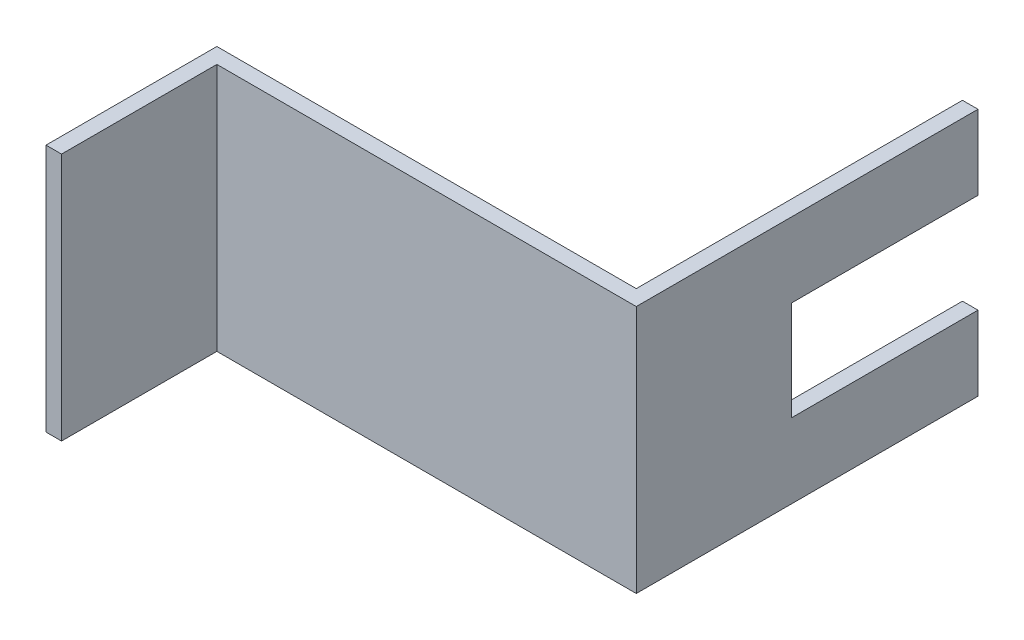
ISO-10303-21;
HEADER;
FILE_DESCRIPTION(('STEP AP214'),'2;1');
FILE_NAME('part.step','',(''),(''),'','','');
FILE_SCHEMA(('AUTOMOTIVE_DESIGN { 1 0 10303 214 1 1 1 1 }'));
ENDSEC;
DATA;
#1=APPLICATION_CONTEXT('core data for automotive mechanical design processes');
#2=APPLICATION_PROTOCOL_DEFINITION('international standard','automotive_design',2000,#1);
#3=PRODUCT_CONTEXT('',#1,'mechanical');
#4=PRODUCT('Part','Part','',(#3));
#5=PRODUCT_RELATED_PRODUCT_CATEGORY('part','',(#4));
#6=PRODUCT_DEFINITION_FORMATION('','',#4);
#7=PRODUCT_DEFINITION_CONTEXT('part definition',#1,'design');
#8=PRODUCT_DEFINITION('design','',#6,#7);
#9=PRODUCT_DEFINITION_SHAPE('','',#8);
#10=(LENGTH_UNIT() NAMED_UNIT(*) SI_UNIT(.MILLI.,.METRE.));
#11=(NAMED_UNIT(*) PLANE_ANGLE_UNIT() SI_UNIT($,.RADIAN.));
#12=(NAMED_UNIT(*) SI_UNIT($,.STERADIAN.) SOLID_ANGLE_UNIT());
#13=UNCERTAINTY_MEASURE_WITH_UNIT(LENGTH_MEASURE(1.E-05),#10,'distance_accuracy_value','');
#14=(GEOMETRIC_REPRESENTATION_CONTEXT(3) GLOBAL_UNCERTAINTY_ASSIGNED_CONTEXT((#13)) GLOBAL_UNIT_ASSIGNED_CONTEXT((#10,
#11,#12)) REPRESENTATION_CONTEXT('',''));
#15=CARTESIAN_POINT('',(0.,0.,0.));
#16=DIRECTION('',(0.,0.,1.));
#17=DIRECTION('',(1.,0.,0.));
#18=AXIS2_PLACEMENT_3D('',#15,#16,#17);
#19=CARTESIAN_POINT('',(7.61995771801081E-13,25.4,-26.8591148249153));
#20=DIRECTION('',(0.,0.,1.));
#21=DIRECTION('',(1.,0.,0.));
#22=AXIS2_PLACEMENT_3D('',#19,#20,#21);
#23=PLANE('',#22);
#24=DIRECTION('',(0.,-1.,0.));
#25=VECTOR('',#24,1.);
#26=CARTESIAN_POINT('',(28.0639133228681,25.4,-26.8591148249145));
#27=LINE('',#26,#25);
#28=CARTESIAN_POINT('',(28.0639133228681,7.62,-26.8591148249146));
#29=VERTEX_POINT('',#28);
#30=CARTESIAN_POINT('',(28.0639133228681,0.,-26.8591148249145));
#31=VERTEX_POINT('',#30);
#32=EDGE_CURVE('E165',#29,#31,#27,.T.);
#33=ORIENTED_EDGE('',*,*,#32,.F.);
#34=DIRECTION('',(1.,0.,0.));
#35=VECTOR('',#34,1.);
#36=CARTESIAN_POINT('',(4.25141332286807,7.62,-26.8591148249146));
#37=LINE('',#36,#35);
#38=CARTESIAN_POINT('',(29.6514133228681,7.62,-26.8591148249146));
#39=VERTEX_POINT('',#38);
#40=EDGE_CURVE('E146',#29,#39,#37,.T.);
#41=ORIENTED_EDGE('',*,*,#40,.T.);
#42=DIRECTION('',(0.,-1.,0.));
#43=VECTOR('',#42,1.);
#44=CARTESIAN_POINT('',(29.6514133228681,25.4,-26.8591148249145));
#45=LINE('',#44,#43);
#46=CARTESIAN_POINT('',(29.6514133228681,0.,-26.8591148249145));
#47=VERTEX_POINT('',#46);
#48=EDGE_CURVE('E169',#39,#47,#45,.T.);
#49=ORIENTED_EDGE('',*,*,#48,.T.);
#50=DIRECTION('',(-1.,0.,0.));
#51=VECTOR('',#50,1.);
#52=CARTESIAN_POINT('',(7.61995771801081E-13,0.,-26.8591148249153));
#53=LINE('',#52,#51);
#54=EDGE_CURVE('E151',#47,#31,#53,.T.);
#55=ORIENTED_EDGE('',*,*,#54,.T.);
#56=EDGE_LOOP('',(#33,#41,#49,#55));
#57=FACE_BOUND('',#56,.T.);
#58=ADVANCED_FACE('F34',(#57),#23,.F.);
#59=CARTESIAN_POINT('',(-13.2110866771319,25.4,0.));
#60=DIRECTION('',(-1.,0.,0.));
#61=DIRECTION('',(0.,0.,1.));
#62=AXIS2_PLACEMENT_3D('',#59,#60,#61);
#63=PLANE('',#62);
#64=DIRECTION('',(0.,0.,-1.));
#65=VECTOR('',#64,1.);
#66=CARTESIAN_POINT('',(-13.2110866771319,0.,0.));
#67=LINE('',#66,#65);
#68=CARTESIAN_POINT('',(-13.2110866771319,0.,23.9408851750854));
#69=VERTEX_POINT('',#68);
#70=CARTESIAN_POINT('',(-13.2110866771319,0.,8.06588517508544));
#71=VERTEX_POINT('',#70);
#72=EDGE_CURVE('E142',#69,#71,#67,.T.);
#73=ORIENTED_EDGE('',*,*,#72,.T.);
#74=DIRECTION('',(0.,-1.,0.));
#75=VECTOR('',#74,1.);
#76=CARTESIAN_POINT('',(-13.2110866771319,25.4,8.06588517508544));
#77=LINE('',#76,#75);
#78=CARTESIAN_POINT('',(-13.2110866771319,25.4,8.06588517508544));
#79=VERTEX_POINT('',#78);
#80=EDGE_CURVE('E176',#79,#71,#77,.T.);
#81=ORIENTED_EDGE('',*,*,#80,.F.);
#82=DIRECTION('',(0.,0.,-1.));
#83=VECTOR('',#82,1.);
#84=CARTESIAN_POINT('',(-13.2110866771319,25.4,0.));
#85=LINE('',#84,#83);
#86=CARTESIAN_POINT('',(-13.2110866771319,25.4,23.9408851750854));
#87=VERTEX_POINT('',#86);
#88=EDGE_CURVE('E161',#87,#79,#85,.T.);
#89=ORIENTED_EDGE('',*,*,#88,.F.);
#90=DIRECTION('',(0.,-1.,0.));
#91=VECTOR('',#90,1.);
#92=CARTESIAN_POINT('',(-13.2110866771319,25.4,23.9408851750854));
#93=LINE('',#92,#91);
#94=EDGE_CURVE('E138',#87,#69,#93,.T.);
#95=ORIENTED_EDGE('',*,*,#94,.T.);
#96=EDGE_LOOP('',(#73,#81,#89,#95));
#97=FACE_BOUND('',#96,.T.);
#98=ADVANCED_FACE('F36',(#97),#63,.F.);
#99=CARTESIAN_POINT('',(0.,25.4,8.06588517508544));
#100=DIRECTION('',(0.,0.,-1.));
#101=DIRECTION('',(-1.,0.,0.));
#102=AXIS2_PLACEMENT_3D('',#99,#100,#101);
#103=PLANE('',#102);
#104=DIRECTION('',(1.,0.,0.));
#105=VECTOR('',#104,1.);
#106=CARTESIAN_POINT('',(0.,0.,8.06588517508544));
#107=LINE('',#106,#105);
#108=CARTESIAN_POINT('',(29.6514133228681,0.,8.06588517508544));
#109=VERTEX_POINT('',#108);
#110=EDGE_CURVE('E145',#71,#109,#107,.T.);
#111=ORIENTED_EDGE('',*,*,#110,.T.);
#112=DIRECTION('',(0.,-1.,0.));
#113=VECTOR('',#112,1.);
#114=CARTESIAN_POINT('',(29.6514133228681,25.4,8.06588517508544));
#115=LINE('',#114,#113);
#116=CARTESIAN_POINT('',(29.6514133228681,25.4,8.06588517508544));
#117=VERTEX_POINT('',#116);
#118=EDGE_CURVE('E173',#117,#109,#115,.T.);
#119=ORIENTED_EDGE('',*,*,#118,.F.);
#120=DIRECTION('',(1.,0.,0.));
#121=VECTOR('',#120,1.);
#122=CARTESIAN_POINT('',(0.,25.4,8.06588517508544));
#123=LINE('',#122,#121);
#124=EDGE_CURVE('E100',#79,#117,#123,.T.);
#125=ORIENTED_EDGE('',*,*,#124,.F.);
#126=ORIENTED_EDGE('',*,*,#80,.T.);
#127=EDGE_LOOP('',(#111,#119,#125,#126));
#128=FACE_BOUND('',#127,.T.);
#129=ADVANCED_FACE('F229',(#128),#103,.F.);
#130=CARTESIAN_POINT('',(29.6514133228681,25.4,0.));
#131=DIRECTION('',(-1.,0.,0.));
#132=DIRECTION('',(0.,0.,1.));
#133=AXIS2_PLACEMENT_3D('',#130,#131,#132);
#134=PLANE('',#133);
#135=ORIENTED_EDGE('',*,*,#48,.F.);
#136=DIRECTION('',(0.,0.,-1.));
#137=VECTOR('',#136,1.);
#138=CARTESIAN_POINT('',(29.6514133228681,7.62,-26.8591148249146));
#139=LINE('',#138,#137);
#140=CARTESIAN_POINT('',(29.6514133228681,7.62,-7.80911482491456));
#141=VERTEX_POINT('',#140);
#142=EDGE_CURVE('E206',#141,#39,#139,.T.);
#143=ORIENTED_EDGE('',*,*,#142,.F.);
#144=DIRECTION('',(0.,-1.,0.));
#145=VECTOR('',#144,1.);
#146=CARTESIAN_POINT('',(29.6514133228681,17.78,-7.80911482491456));
#147=LINE('',#146,#145);
#148=CARTESIAN_POINT('',(29.6514133228681,17.78,-7.80911482491456));
#149=VERTEX_POINT('',#148);
#150=EDGE_CURVE('E210',#149,#141,#147,.T.);
#151=ORIENTED_EDGE('',*,*,#150,.F.);
#152=DIRECTION('',(0.,0.,1.));
#153=VECTOR('',#152,1.);
#154=CARTESIAN_POINT('',(29.6514133228681,17.78,-26.8591148249146));
#155=LINE('',#154,#153);
#156=CARTESIAN_POINT('',(29.6514133228681,17.78,-26.8591148249146));
#157=VERTEX_POINT('',#156);
#158=EDGE_CURVE('E235',#157,#149,#155,.T.);
#159=ORIENTED_EDGE('',*,*,#158,.F.);
#160=CARTESIAN_POINT('',(29.6514133228681,25.4,-26.8591148249145));
#161=VERTEX_POINT('',#160);
#162=EDGE_CURVE('E170',#161,#157,#45,.T.);
#163=ORIENTED_EDGE('',*,*,#162,.F.);
#164=DIRECTION('',(0.,0.,-1.));
#165=VECTOR('',#164,1.);
#166=CARTESIAN_POINT('',(29.6514133228681,25.4,0.));
#167=LINE('',#166,#165);
#168=EDGE_CURVE('E216',#117,#161,#167,.T.);
#169=ORIENTED_EDGE('',*,*,#168,.F.);
#170=ORIENTED_EDGE('',*,*,#118,.T.);
#171=DIRECTION('',(0.,0.,-1.));
#172=VECTOR('',#171,1.);
#173=CARTESIAN_POINT('',(29.6514133228681,0.,0.));
#174=LINE('',#173,#172);
#175=EDGE_CURVE('E148',#109,#47,#174,.T.);
#176=ORIENTED_EDGE('',*,*,#175,.T.);
#177=EDGE_LOOP('',(#135,#143,#151,#159,#163,#169,#170,#176));
#178=FACE_BOUND('',#177,.T.);
#179=ADVANCED_FACE('F233',(#178),#134,.F.);
#180=ORIENTED_EDGE('',*,*,#162,.T.);
#181=DIRECTION('',(1.,0.,0.));
#182=VECTOR('',#181,1.);
#183=CARTESIAN_POINT('',(4.25141332286807,17.78,-26.8591148249146));
#184=LINE('',#183,#182);
#185=CARTESIAN_POINT('',(28.0639133228681,17.78,-26.8591148249146));
#186=VERTEX_POINT('',#185);
#187=EDGE_CURVE('E198',#186,#157,#184,.T.);
#188=ORIENTED_EDGE('',*,*,#187,.F.);
#189=CARTESIAN_POINT('',(28.0639133228681,25.4,-26.8591148249145));
#190=VERTEX_POINT('',#189);
#191=EDGE_CURVE('E166',#190,#186,#27,.T.);
#192=ORIENTED_EDGE('',*,*,#191,.F.);
#193=DIRECTION('',(-1.,0.,0.));
#194=VECTOR('',#193,1.);
#195=CARTESIAN_POINT('',(7.61995771801081E-13,25.4,-26.8591148249153));
#196=LINE('',#195,#194);
#197=EDGE_CURVE('E218',#161,#190,#196,.T.);
#198=ORIENTED_EDGE('',*,*,#197,.F.);
#199=EDGE_LOOP('',(#180,#188,#192,#198));
#200=FACE_BOUND('',#199,.T.);
#201=ADVANCED_FACE('F203',(#200),#23,.F.);
#202=CARTESIAN_POINT('',(28.0639133228681,25.4,0.));
#203=DIRECTION('',(-1.,0.,0.));
#204=DIRECTION('',(0.,0.,1.));
#205=AXIS2_PLACEMENT_3D('',#202,#203,#204);
#206=PLANE('',#205);
#207=DIRECTION('',(0.,0.,1.));
#208=VECTOR('',#207,1.);
#209=CARTESIAN_POINT('',(28.0639133228681,7.62,0.));
#210=LINE('',#209,#208);
#211=CARTESIAN_POINT('',(28.0639133228681,7.62,-7.80911482491456));
#212=VERTEX_POINT('',#211);
#213=EDGE_CURVE('E11',#29,#212,#210,.T.);
#214=ORIENTED_EDGE('',*,*,#213,.F.);
#215=ORIENTED_EDGE('',*,*,#32,.T.);
#216=DIRECTION('',(0.,0.,-1.));
#217=VECTOR('',#216,1.);
#218=CARTESIAN_POINT('',(28.0639133228681,0.,0.));
#219=LINE('',#218,#217);
#220=CARTESIAN_POINT('',(28.0639133228681,0.,6.47838517508544));
#221=VERTEX_POINT('',#220);
#222=EDGE_CURVE('E154',#221,#31,#219,.T.);
#223=ORIENTED_EDGE('',*,*,#222,.F.);
#224=DIRECTION('',(0.,-1.,0.));
#225=VECTOR('',#224,1.);
#226=CARTESIAN_POINT('',(28.0639133228681,25.4,6.47838517508544));
#227=LINE('',#226,#225);
#228=CARTESIAN_POINT('',(28.0639133228681,25.4,6.47838517508544));
#229=VERTEX_POINT('',#228);
#230=EDGE_CURVE('E133',#229,#221,#227,.T.);
#231=ORIENTED_EDGE('',*,*,#230,.F.);
#232=DIRECTION('',(0.,0.,-1.));
#233=VECTOR('',#232,1.);
#234=CARTESIAN_POINT('',(28.0639133228681,25.4,0.));
#235=LINE('',#234,#233);
#236=EDGE_CURVE('E123',#229,#190,#235,.T.);
#237=ORIENTED_EDGE('',*,*,#236,.T.);
#238=ORIENTED_EDGE('',*,*,#191,.T.);
#239=DIRECTION('',(0.,0.,-1.));
#240=VECTOR('',#239,1.);
#241=CARTESIAN_POINT('',(28.0639133228681,17.78,0.));
#242=LINE('',#241,#240);
#243=CARTESIAN_POINT('',(28.0639133228681,17.78,-7.80911482491456));
#244=VERTEX_POINT('',#243);
#245=EDGE_CURVE('E178',#244,#186,#242,.T.);
#246=ORIENTED_EDGE('',*,*,#245,.F.);
#247=DIRECTION('',(0.,1.,0.));
#248=VECTOR('',#247,1.);
#249=CARTESIAN_POINT('',(28.0639133228681,25.4,-7.80911482491456));
#250=LINE('',#249,#248);
#251=EDGE_CURVE('E42',#212,#244,#250,.T.);
#252=ORIENTED_EDGE('',*,*,#251,.F.);
#253=EDGE_LOOP('',(#214,#215,#223,#231,#237,#238,#246,#252));
#254=FACE_BOUND('',#253,.T.);
#255=ADVANCED_FACE('F191',(#254),#206,.T.);
#256=CARTESIAN_POINT('',(0.,25.4,6.47838517508545));
#257=DIRECTION('',(0.,0.,1.));
#258=DIRECTION('',(1.,0.,0.));
#259=AXIS2_PLACEMENT_3D('',#256,#257,#258);
#260=PLANE('',#259);
#261=DIRECTION('',(-1.,0.,0.));
#262=VECTOR('',#261,1.);
#263=CARTESIAN_POINT('',(0.,0.,6.47838517508545));
#264=LINE('',#263,#262);
#265=CARTESIAN_POINT('',(-14.7985866771319,0.,6.47838517508545));
#266=VERTEX_POINT('',#265);
#267=EDGE_CURVE('E130',#221,#266,#264,.T.);
#268=ORIENTED_EDGE('',*,*,#267,.T.);
#269=DIRECTION('',(0.,-1.,0.));
#270=VECTOR('',#269,1.);
#271=CARTESIAN_POINT('',(-14.7985866771319,25.4,6.47838517508545));
#272=LINE('',#271,#270);
#273=CARTESIAN_POINT('',(-14.7985866771319,25.4,6.47838517508545));
#274=VERTEX_POINT('',#273);
#275=EDGE_CURVE('E127',#274,#266,#272,.T.);
#276=ORIENTED_EDGE('',*,*,#275,.F.);
#277=DIRECTION('',(-1.,0.,0.));
#278=VECTOR('',#277,1.);
#279=CARTESIAN_POINT('',(0.,25.4,6.47838517508545));
#280=LINE('',#279,#278);
#281=EDGE_CURVE('E116',#229,#274,#280,.T.);
#282=ORIENTED_EDGE('',*,*,#281,.F.);
#283=ORIENTED_EDGE('',*,*,#230,.T.);
#284=EDGE_LOOP('',(#268,#276,#282,#283));
#285=FACE_BOUND('',#284,.T.);
#286=ADVANCED_FACE('F128',(#285),#260,.F.);
#287=CARTESIAN_POINT('',(-14.7985866771319,25.4,0.));
#288=DIRECTION('',(1.,0.,0.));
#289=DIRECTION('',(0.,0.,-1.));
#290=AXIS2_PLACEMENT_3D('',#287,#288,#289);
#291=PLANE('',#290);
#292=DIRECTION('',(0.,0.,1.));
#293=VECTOR('',#292,1.);
#294=CARTESIAN_POINT('',(-14.7985866771319,0.,0.));
#295=LINE('',#294,#293);
#296=CARTESIAN_POINT('',(-14.7985866771319,0.,23.9408851750854));
#297=VERTEX_POINT('',#296);
#298=EDGE_CURVE('E158',#266,#297,#295,.T.);
#299=ORIENTED_EDGE('',*,*,#298,.T.);
#300=DIRECTION('',(0.,-1.,0.));
#301=VECTOR('',#300,1.);
#302=CARTESIAN_POINT('',(-14.7985866771319,25.4,23.9408851750854));
#303=LINE('',#302,#301);
#304=CARTESIAN_POINT('',(-14.7985866771319,25.4,23.9408851750854));
#305=VERTEX_POINT('',#304);
#306=EDGE_CURVE('E134',#305,#297,#303,.T.);
#307=ORIENTED_EDGE('',*,*,#306,.F.);
#308=DIRECTION('',(0.,0.,1.));
#309=VECTOR('',#308,1.);
#310=CARTESIAN_POINT('',(-14.7985866771319,25.4,0.));
#311=LINE('',#310,#309);
#312=EDGE_CURVE('E120',#274,#305,#311,.T.);
#313=ORIENTED_EDGE('',*,*,#312,.F.);
#314=ORIENTED_EDGE('',*,*,#275,.T.);
#315=EDGE_LOOP('',(#299,#307,#313,#314));
#316=FACE_BOUND('',#315,.T.);
#317=ADVANCED_FACE('F136',(#316),#291,.F.);
#318=CARTESIAN_POINT('',(0.,25.4,23.9408851750854));
#319=DIRECTION('',(0.,0.,-1.));
#320=DIRECTION('',(-1.,0.,0.));
#321=AXIS2_PLACEMENT_3D('',#318,#319,#320);
#322=PLANE('',#321);
#323=DIRECTION('',(1.,0.,0.));
#324=VECTOR('',#323,1.);
#325=CARTESIAN_POINT('',(0.,0.,23.9408851750854));
#326=LINE('',#325,#324);
#327=EDGE_CURVE('E91',#297,#69,#326,.T.);
#328=ORIENTED_EDGE('',*,*,#327,.T.);
#329=ORIENTED_EDGE('',*,*,#94,.F.);
#330=DIRECTION('',(1.,0.,0.));
#331=VECTOR('',#330,1.);
#332=CARTESIAN_POINT('',(0.,25.4,23.9408851750854));
#333=LINE('',#332,#331);
#334=EDGE_CURVE('E58',#305,#87,#333,.T.);
#335=ORIENTED_EDGE('',*,*,#334,.F.);
#336=ORIENTED_EDGE('',*,*,#306,.T.);
#337=EDGE_LOOP('',(#328,#329,#335,#336));
#338=FACE_BOUND('',#337,.T.);
#339=ADVANCED_FACE('F224',(#338),#322,.F.);
#340=CARTESIAN_POINT('',(0.,25.4,0.));
#341=DIRECTION('',(0.,1.,0.));
#342=DIRECTION('',(0.,0.,1.));
#343=AXIS2_PLACEMENT_3D('',#340,#341,#342);
#344=PLANE('',#343);
#345=ORIENTED_EDGE('',*,*,#88,.T.);
#346=ORIENTED_EDGE('',*,*,#124,.T.);
#347=ORIENTED_EDGE('',*,*,#168,.T.);
#348=ORIENTED_EDGE('',*,*,#197,.T.);
#349=ORIENTED_EDGE('',*,*,#236,.F.);
#350=ORIENTED_EDGE('',*,*,#281,.T.);
#351=ORIENTED_EDGE('',*,*,#312,.T.);
#352=ORIENTED_EDGE('',*,*,#334,.T.);
#353=EDGE_LOOP('',(#345,#346,#347,#348,#349,#350,#351,#352));
#354=FACE_BOUND('',#353,.T.);
#355=ADVANCED_FACE('F118',(#354),#344,.T.);
#356=CARTESIAN_POINT('',(0.,0.,0.));
#357=DIRECTION('',(0.,1.,0.));
#358=DIRECTION('',(0.,0.,1.));
#359=AXIS2_PLACEMENT_3D('',#356,#357,#358);
#360=PLANE('',#359);
#361=ORIENTED_EDGE('',*,*,#72,.F.);
#362=ORIENTED_EDGE('',*,*,#327,.F.);
#363=ORIENTED_EDGE('',*,*,#298,.F.);
#364=ORIENTED_EDGE('',*,*,#267,.F.);
#365=ORIENTED_EDGE('',*,*,#222,.T.);
#366=ORIENTED_EDGE('',*,*,#54,.F.);
#367=ORIENTED_EDGE('',*,*,#175,.F.);
#368=ORIENTED_EDGE('',*,*,#110,.F.);
#369=EDGE_LOOP('',(#361,#362,#363,#364,#365,#366,#367,#368));
#370=FACE_BOUND('',#369,.T.);
#371=ADVANCED_FACE('F222',(#370),#360,.F.);
#372=CARTESIAN_POINT('',(4.25141332286807,7.62,-26.8591148249146));
#373=DIRECTION('',(0.,-1.,0.));
#374=DIRECTION('',(0.,0.,-1.));
#375=AXIS2_PLACEMENT_3D('',#372,#373,#374);
#376=PLANE('',#375);
#377=ORIENTED_EDGE('',*,*,#213,.T.);
#378=DIRECTION('',(1.,0.,0.));
#379=VECTOR('',#378,1.);
#380=CARTESIAN_POINT('',(4.25141332286807,7.62,-7.80911482491456));
#381=LINE('',#380,#379);
#382=EDGE_CURVE('E188',#212,#141,#381,.T.);
#383=ORIENTED_EDGE('',*,*,#382,.T.);
#384=ORIENTED_EDGE('',*,*,#142,.T.);
#385=ORIENTED_EDGE('',*,*,#40,.F.);
#386=EDGE_LOOP('',(#377,#383,#384,#385));
#387=FACE_BOUND('',#386,.T.);
#388=ADVANCED_FACE('F244',(#387),#376,.F.);
#389=CARTESIAN_POINT('',(4.25141332286807,17.78,-7.80911482491456));
#390=DIRECTION('',(0.,0.,1.));
#391=DIRECTION('',(1.,0.,0.));
#392=AXIS2_PLACEMENT_3D('',#389,#390,#391);
#393=PLANE('',#392);
#394=ORIENTED_EDGE('',*,*,#251,.T.);
#395=DIRECTION('',(1.,0.,0.));
#396=VECTOR('',#395,1.);
#397=CARTESIAN_POINT('',(4.25141332286807,17.78,-7.80911482491456));
#398=LINE('',#397,#396);
#399=EDGE_CURVE('E49',#244,#149,#398,.T.);
#400=ORIENTED_EDGE('',*,*,#399,.T.);
#401=ORIENTED_EDGE('',*,*,#150,.T.);
#402=ORIENTED_EDGE('',*,*,#382,.F.);
#403=EDGE_LOOP('',(#394,#400,#401,#402));
#404=FACE_BOUND('',#403,.T.);
#405=ADVANCED_FACE('F183',(#404),#393,.F.);
#406=CARTESIAN_POINT('',(4.25141332286807,17.78,-26.8591148249146));
#407=DIRECTION('',(0.,1.,0.));
#408=DIRECTION('',(0.,0.,1.));
#409=AXIS2_PLACEMENT_3D('',#406,#407,#408);
#410=PLANE('',#409);
#411=ORIENTED_EDGE('',*,*,#245,.T.);
#412=ORIENTED_EDGE('',*,*,#187,.T.);
#413=ORIENTED_EDGE('',*,*,#158,.T.);
#414=ORIENTED_EDGE('',*,*,#399,.F.);
#415=EDGE_LOOP('',(#411,#412,#413,#414));
#416=FACE_BOUND('',#415,.T.);
#417=ADVANCED_FACE('F196',(#416),#410,.F.);
#418=CLOSED_SHELL('',(#58,#98,#129,#179,#201,#255,#286,#317,#339,#355,#371,#388,#405,#417));
#419=MANIFOLD_SOLID_BREP('B2',#418);
#420=ADVANCED_BREP_SHAPE_REPRESENTATION('',(#18,#419),#14);
#421=SHAPE_DEFINITION_REPRESENTATION(#9,#420);
ENDSEC;
END-ISO-10303-21;
